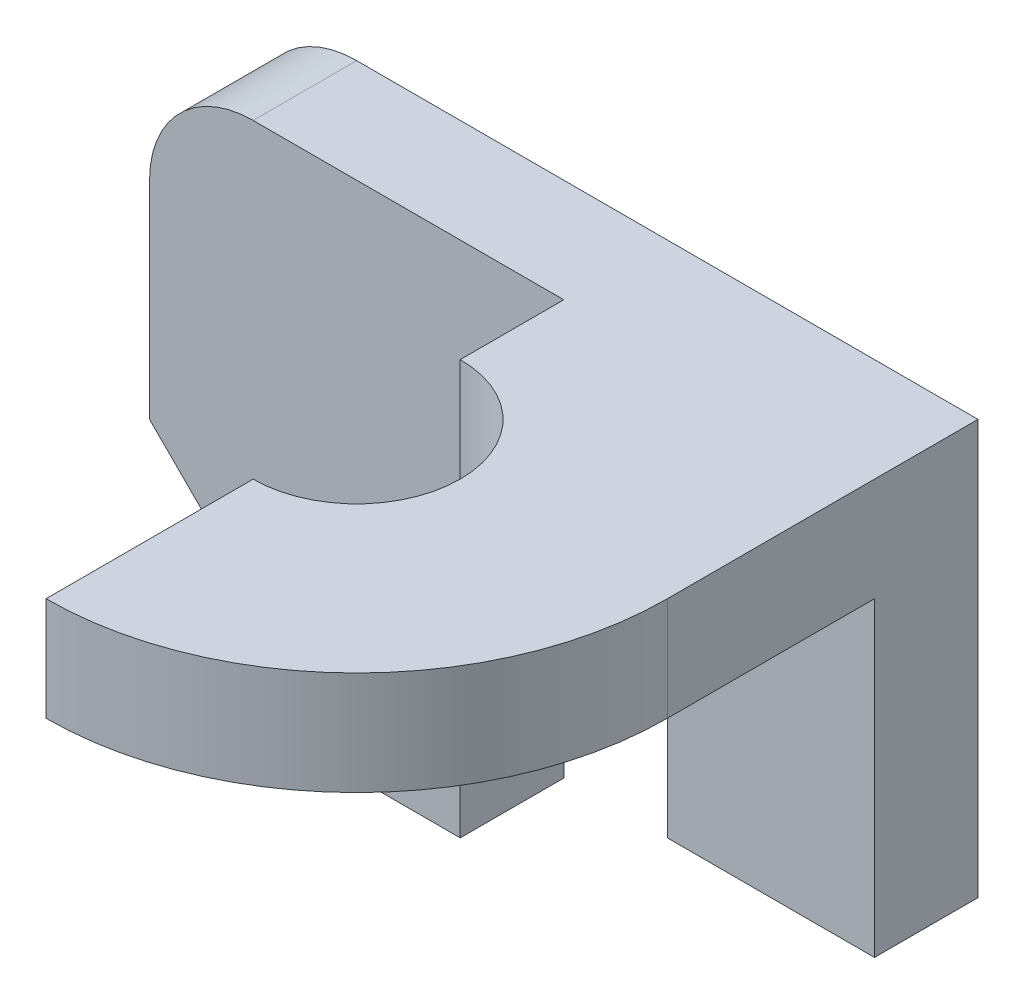
ISO-10303-21;
HEADER;
FILE_DESCRIPTION(('STEP AP214'),'2;1');
FILE_NAME('part.step','',(''),(''),'','','');
FILE_SCHEMA(('AUTOMOTIVE_DESIGN { 1 0 10303 214 1 1 1 1 }'));
ENDSEC;
DATA;
#1=APPLICATION_CONTEXT('core data for automotive mechanical design processes');
#2=APPLICATION_PROTOCOL_DEFINITION('international standard','automotive_design',2000,#1);
#3=PRODUCT_CONTEXT('',#1,'mechanical');
#4=PRODUCT('Part','Part','',(#3));
#5=PRODUCT_RELATED_PRODUCT_CATEGORY('part','',(#4));
#6=PRODUCT_DEFINITION_FORMATION('','',#4);
#7=PRODUCT_DEFINITION_CONTEXT('part definition',#1,'design');
#8=PRODUCT_DEFINITION('design','',#6,#7);
#9=PRODUCT_DEFINITION_SHAPE('','',#8);
#10=(LENGTH_UNIT() NAMED_UNIT(*) SI_UNIT(.MILLI.,.METRE.));
#11=(NAMED_UNIT(*) PLANE_ANGLE_UNIT() SI_UNIT($,.RADIAN.));
#12=(NAMED_UNIT(*) SI_UNIT($,.STERADIAN.) SOLID_ANGLE_UNIT());
#13=UNCERTAINTY_MEASURE_WITH_UNIT(LENGTH_MEASURE(1.E-05),#10,'distance_accuracy_value','');
#14=(GEOMETRIC_REPRESENTATION_CONTEXT(3) GLOBAL_UNCERTAINTY_ASSIGNED_CONTEXT((#13)) GLOBAL_UNIT_ASSIGNED_CONTEXT((#10,
#11,#12)) REPRESENTATION_CONTEXT('',''));
#15=CARTESIAN_POINT('',(0.,0.,0.));
#16=DIRECTION('',(0.,0.,1.));
#17=DIRECTION('',(1.,0.,0.));
#18=AXIS2_PLACEMENT_3D('',#15,#16,#17);
#19=CARTESIAN_POINT('',(0.,0.,1.));
#20=DIRECTION('',(1.,0.,0.));
#21=DIRECTION('',(0.,0.,-1.));
#22=AXIS2_PLACEMENT_3D('',#19,#20,#21);
#23=PLANE('',#22);
#24=DIRECTION('',(0.,-1.,0.));
#25=VECTOR('',#24,1.);
#26=CARTESIAN_POINT('',(0.,0.,0.));
#27=LINE('',#26,#25);
#28=CARTESIAN_POINT('',(0.,0.999999999999999,0.));
#29=VERTEX_POINT('',#28);
#30=CARTESIAN_POINT('',(0.,0.,0.));
#31=VERTEX_POINT('',#30);
#32=EDGE_CURVE('E154',#29,#31,#27,.T.);
#33=ORIENTED_EDGE('',*,*,#32,.T.);
#34=DIRECTION('',(0.,0.,-1.));
#35=VECTOR('',#34,1.);
#36=CARTESIAN_POINT('',(0.,0.,1.));
#37=LINE('',#36,#35);
#38=CARTESIAN_POINT('',(0.,0.,1.));
#39=VERTEX_POINT('',#38);
#40=EDGE_CURVE('E11',#39,#31,#37,.T.);
#41=ORIENTED_EDGE('',*,*,#40,.F.);
#42=DIRECTION('',(0.,-1.,0.));
#43=VECTOR('',#42,1.);
#44=CARTESIAN_POINT('',(0.,0.,1.));
#45=LINE('',#44,#43);
#46=CARTESIAN_POINT('',(0.,0.999999999999999,1.));
#47=VERTEX_POINT('',#46);
#48=EDGE_CURVE('E174',#47,#39,#45,.T.);
#49=ORIENTED_EDGE('',*,*,#48,.F.);
#50=DIRECTION('',(0.,0.,-1.));
#51=VECTOR('',#50,1.);
#52=CARTESIAN_POINT('',(0.,0.999999999999999,1.));
#53=LINE('',#52,#51);
#54=EDGE_CURVE('E150',#47,#29,#53,.T.);
#55=ORIENTED_EDGE('',*,*,#54,.T.);
#56=EDGE_LOOP('',(#33,#41,#49,#55));
#57=FACE_BOUND('',#56,.T.);
#58=ADVANCED_FACE('F34',(#57),#23,.F.);
#59=CARTESIAN_POINT('',(0.,0.,1.));
#60=DIRECTION('',(0.,1.,0.));
#61=DIRECTION('',(0.,0.,1.));
#62=AXIS2_PLACEMENT_3D('',#59,#60,#61);
#63=PLANE('',#62);
#64=DIRECTION('',(1.,0.,0.));
#65=VECTOR('',#64,1.);
#66=CARTESIAN_POINT('',(0.,0.,0.));
#67=LINE('',#66,#65);
#68=CARTESIAN_POINT('',(2.,0.,0.));
#69=VERTEX_POINT('',#68);
#70=EDGE_CURVE('E157',#31,#69,#67,.T.);
#71=ORIENTED_EDGE('',*,*,#70,.T.);
#72=DIRECTION('',(0.,0.,-1.));
#73=VECTOR('',#72,1.);
#74=CARTESIAN_POINT('',(2.,0.,1.));
#75=LINE('',#74,#73);
#76=CARTESIAN_POINT('',(2.,0.,1.));
#77=VERTEX_POINT('',#76);
#78=EDGE_CURVE('E42',#77,#69,#75,.T.);
#79=ORIENTED_EDGE('',*,*,#78,.F.);
#80=DIRECTION('',(1.,0.,0.));
#81=VECTOR('',#80,1.);
#82=CARTESIAN_POINT('',(0.,0.,1.));
#83=LINE('',#82,#81);
#84=EDGE_CURVE('E106',#39,#77,#83,.T.);
#85=ORIENTED_EDGE('',*,*,#84,.F.);
#86=ORIENTED_EDGE('',*,*,#40,.T.);
#87=EDGE_LOOP('',(#71,#79,#85,#86));
#88=FACE_BOUND('',#87,.T.);
#89=ADVANCED_FACE('F318',(#88),#63,.F.);
#90=CARTESIAN_POINT('',(2.,0.,1.));
#91=DIRECTION('',(-1.,0.,0.));
#92=DIRECTION('',(0.,0.,1.));
#93=AXIS2_PLACEMENT_3D('',#90,#91,#92);
#94=PLANE('',#93);
#95=DIRECTION('',(0.,1.,0.));
#96=VECTOR('',#95,1.);
#97=CARTESIAN_POINT('',(2.,0.,0.));
#98=LINE('',#97,#96);
#99=CARTESIAN_POINT('',(2.,4.,0.));
#100=VERTEX_POINT('',#99);
#101=EDGE_CURVE('E160',#69,#100,#98,.T.);
#102=ORIENTED_EDGE('',*,*,#101,.T.);
#103=DIRECTION('',(0.,0.,-1.));
#104=VECTOR('',#103,1.);
#105=CARTESIAN_POINT('',(2.,4.,1.));
#106=LINE('',#105,#104);
#107=CARTESIAN_POINT('',(2.,4.,3.));
#108=VERTEX_POINT('',#107);
#109=EDGE_CURVE('E187',#108,#100,#106,.T.);
#110=ORIENTED_EDGE('',*,*,#109,.F.);
#111=DIRECTION('',(0.,1.,0.));
#112=VECTOR('',#111,1.);
#113=CARTESIAN_POINT('',(2.,3.,3.));
#114=LINE('',#113,#112);
#115=CARTESIAN_POINT('',(2.,3.,3.));
#116=VERTEX_POINT('',#115);
#117=EDGE_CURVE('E233',#116,#108,#114,.T.);
#118=ORIENTED_EDGE('',*,*,#117,.F.);
#119=DIRECTION('',(0.,0.,-1.));
#120=VECTOR('',#119,1.);
#121=CARTESIAN_POINT('',(2.,3.,1.));
#122=LINE('',#121,#120);
#123=CARTESIAN_POINT('',(2.,3.,1.));
#124=VERTEX_POINT('',#123);
#125=EDGE_CURVE('E244',#116,#124,#122,.T.);
#126=ORIENTED_EDGE('',*,*,#125,.T.);
#127=DIRECTION('',(0.,1.,0.));
#128=VECTOR('',#127,1.);
#129=CARTESIAN_POINT('',(2.,0.,1.));
#130=LINE('',#129,#128);
#131=EDGE_CURVE('E192',#77,#124,#130,.T.);
#132=ORIENTED_EDGE('',*,*,#131,.F.);
#133=ORIENTED_EDGE('',*,*,#78,.T.);
#134=EDGE_LOOP('',(#102,#110,#118,#126,#132,#133));
#135=FACE_BOUND('',#134,.T.);
#136=ADVANCED_FACE('F317',(#135),#94,.F.);
#137=CARTESIAN_POINT('',(2.,4.,1.));
#138=DIRECTION('',(0.,-1.,0.));
#139=DIRECTION('',(1.,0.,0.));
#140=AXIS2_PLACEMENT_3D('',#137,#138,#139);
#141=PLANE('',#140);
#142=DIRECTION('',(-1.,0.,0.));
#143=VECTOR('',#142,1.);
#144=CARTESIAN_POINT('',(2.,4.,0.));
#145=LINE('',#144,#143);
#146=CARTESIAN_POINT('',(-4.,4.,0.));
#147=VERTEX_POINT('',#146);
#148=EDGE_CURVE('E162',#100,#147,#145,.T.);
#149=ORIENTED_EDGE('',*,*,#148,.T.);
#150=DIRECTION('',(0.,0.,-1.));
#151=VECTOR('',#150,1.);
#152=CARTESIAN_POINT('',(-4.,4.,1.));
#153=LINE('',#152,#151);
#154=CARTESIAN_POINT('',(-4.,4.,1.));
#155=VERTEX_POINT('',#154);
#156=EDGE_CURVE('E184',#155,#147,#153,.T.);
#157=ORIENTED_EDGE('',*,*,#156,.F.);
#158=DIRECTION('',(-1.,0.,0.));
#159=VECTOR('',#158,1.);
#160=CARTESIAN_POINT('',(2.,4.,1.));
#161=LINE('',#160,#159);
#162=CARTESIAN_POINT('',(-1.,4.,1.));
#163=VERTEX_POINT('',#162);
#164=EDGE_CURVE('E195',#163,#155,#161,.T.);
#165=ORIENTED_EDGE('',*,*,#164,.F.);
#166=DIRECTION('',(0.,0.,1.));
#167=VECTOR('',#166,1.);
#168=CARTESIAN_POINT('',(-1.,4.,1.));
#169=LINE('',#168,#167);
#170=CARTESIAN_POINT('',(-1.,4.,2.));
#171=VERTEX_POINT('',#170);
#172=EDGE_CURVE('E50',#163,#171,#169,.T.);
#173=ORIENTED_EDGE('',*,*,#172,.T.);
#174=CARTESIAN_POINT('',(-0.999999999999999,4.,3.));
#175=DIRECTION('',(0.,-1.,0.));
#176=DIRECTION('',(1.,0.,0.));
#177=AXIS2_PLACEMENT_3D('',#174,#175,#176);
#178=CIRCLE('',#177,1.);
#179=CARTESIAN_POINT('',(-1.,4.,4.));
#180=VERTEX_POINT('',#179);
#181=EDGE_CURVE('E304',#171,#180,#178,.T.);
#182=ORIENTED_EDGE('',*,*,#181,.T.);
#183=DIRECTION('',(0.,0.,1.));
#184=VECTOR('',#183,1.);
#185=CARTESIAN_POINT('',(-1.,4.,4.));
#186=LINE('',#185,#184);
#187=CARTESIAN_POINT('',(-1.,4.,6.));
#188=VERTEX_POINT('',#187);
#189=EDGE_CURVE('E306',#180,#188,#186,.T.);
#190=ORIENTED_EDGE('',*,*,#189,.T.);
#191=CARTESIAN_POINT('',(-0.999999999999999,4.,3.));
#192=DIRECTION('',(0.,1.,0.));
#193=DIRECTION('',(1.,0.,0.));
#194=AXIS2_PLACEMENT_3D('',#191,#192,#193);
#195=CIRCLE('',#194,3.);
#196=EDGE_CURVE('E238',#188,#108,#195,.T.);
#197=ORIENTED_EDGE('',*,*,#196,.T.);
#198=ORIENTED_EDGE('',*,*,#109,.T.);
#199=EDGE_LOOP('',(#149,#157,#165,#173,#182,#190,#197,#198));
#200=FACE_BOUND('',#199,.T.);
#201=ADVANCED_FACE('F310',(#200),#141,.F.);
#202=CARTESIAN_POINT('',(-4.,2.99999999999999,1.));
#203=DIRECTION('',(0.,0.,-1.));
#204=DIRECTION('',(-1.,0.,0.));
#205=AXIS2_PLACEMENT_3D('',#202,#203,#204);
#206=CYLINDRICAL_SURFACE('',#205,1.);
#207=CARTESIAN_POINT('',(-4.,2.99999999999999,0.));
#208=DIRECTION('',(0.,0.,1.));
#209=DIRECTION('',(1.,0.,0.));
#210=AXIS2_PLACEMENT_3D('',#207,#208,#209);
#211=CIRCLE('',#210,1.);
#212=CARTESIAN_POINT('',(-5.,3.,0.));
#213=VERTEX_POINT('',#212);
#214=EDGE_CURVE('E164',#147,#213,#211,.T.);
#215=ORIENTED_EDGE('',*,*,#214,.T.);
#216=DIRECTION('',(0.,0.,-1.));
#217=VECTOR('',#216,1.);
#218=CARTESIAN_POINT('',(-5.,3.,1.));
#219=LINE('',#218,#217);
#220=CARTESIAN_POINT('',(-5.,3.,1.));
#221=VERTEX_POINT('',#220);
#222=EDGE_CURVE('E181',#221,#213,#219,.T.);
#223=ORIENTED_EDGE('',*,*,#222,.F.);
#224=CARTESIAN_POINT('',(-4.,2.99999999999999,1.));
#225=DIRECTION('',(0.,0.,1.));
#226=DIRECTION('',(1.,0.,0.));
#227=AXIS2_PLACEMENT_3D('',#224,#225,#226);
#228=CIRCLE('',#227,1.);
#229=EDGE_CURVE('E203',#155,#221,#228,.T.);
#230=ORIENTED_EDGE('',*,*,#229,.F.);
#231=ORIENTED_EDGE('',*,*,#156,.T.);
#232=EDGE_LOOP('',(#215,#223,#230,#231));
#233=FACE_BOUND('',#232,.T.);
#234=ADVANCED_FACE('F315',(#233),#206,.T.);
#235=CARTESIAN_POINT('',(-5.,3.,1.));
#236=DIRECTION('',(1.,0.,0.));
#237=DIRECTION('',(0.,0.,-1.));
#238=AXIS2_PLACEMENT_3D('',#235,#236,#237);
#239=PLANE('',#238);
#240=DIRECTION('',(0.,-1.,0.));
#241=VECTOR('',#240,1.);
#242=CARTESIAN_POINT('',(-5.,3.,0.));
#243=LINE('',#242,#241);
#244=CARTESIAN_POINT('',(-5.,0.999999999999999,0.));
#245=VERTEX_POINT('',#244);
#246=EDGE_CURVE('E166',#213,#245,#243,.T.);
#247=ORIENTED_EDGE('',*,*,#246,.T.);
#248=DIRECTION('',(0.,0.,-1.));
#249=VECTOR('',#248,1.);
#250=CARTESIAN_POINT('',(-5.,0.999999999999999,1.));
#251=LINE('',#250,#249);
#252=CARTESIAN_POINT('',(-5.,0.999999999999999,1.));
#253=VERTEX_POINT('',#252);
#254=EDGE_CURVE('E178',#253,#245,#251,.T.);
#255=ORIENTED_EDGE('',*,*,#254,.F.);
#256=DIRECTION('',(0.,-1.,0.));
#257=VECTOR('',#256,1.);
#258=CARTESIAN_POINT('',(-5.,3.,1.));
#259=LINE('',#258,#257);
#260=EDGE_CURVE('E205',#221,#253,#259,.T.);
#261=ORIENTED_EDGE('',*,*,#260,.F.);
#262=ORIENTED_EDGE('',*,*,#222,.T.);
#263=EDGE_LOOP('',(#247,#255,#261,#262));
#264=FACE_BOUND('',#263,.T.);
#265=ADVANCED_FACE('F211',(#264),#239,.F.);
#266=CARTESIAN_POINT('',(-5.,0.999999999999999,1.));
#267=DIRECTION('',(0.707106781186547,0.707106781186547,0.));
#268=DIRECTION('',(-0.707106781186548,0.707106781186548,0.));
#269=AXIS2_PLACEMENT_3D('',#266,#267,#268);
#270=PLANE('',#269);
#271=DIRECTION('',(0.707106781186548,-0.707106781186548,0.));
#272=VECTOR('',#271,1.);
#273=CARTESIAN_POINT('',(-5.,0.999999999999999,0.));
#274=LINE('',#273,#272);
#275=CARTESIAN_POINT('',(-3.,-1.,0.));
#276=VERTEX_POINT('',#275);
#277=EDGE_CURVE('E168',#245,#276,#274,.T.);
#278=ORIENTED_EDGE('',*,*,#277,.T.);
#279=DIRECTION('',(0.,0.,-1.));
#280=VECTOR('',#279,1.);
#281=CARTESIAN_POINT('',(-3.,-1.,1.));
#282=LINE('',#281,#280);
#283=CARTESIAN_POINT('',(-3.,-1.,1.));
#284=VERTEX_POINT('',#283);
#285=EDGE_CURVE('E145',#284,#276,#282,.T.);
#286=ORIENTED_EDGE('',*,*,#285,.F.);
#287=DIRECTION('',(0.707106781186548,-0.707106781186548,0.));
#288=VECTOR('',#287,1.);
#289=CARTESIAN_POINT('',(-5.,0.999999999999999,1.));
#290=LINE('',#289,#288);
#291=EDGE_CURVE('E133',#253,#284,#290,.T.);
#292=ORIENTED_EDGE('',*,*,#291,.F.);
#293=ORIENTED_EDGE('',*,*,#254,.T.);
#294=EDGE_LOOP('',(#278,#286,#292,#293));
#295=FACE_BOUND('',#294,.T.);
#296=ADVANCED_FACE('F215',(#295),#270,.F.);
#297=CARTESIAN_POINT('',(-3.,-1.,1.));
#298=DIRECTION('',(0.,1.,0.));
#299=DIRECTION('',(0.,0.,1.));
#300=AXIS2_PLACEMENT_3D('',#297,#298,#299);
#301=PLANE('',#300);
#302=DIRECTION('',(1.,0.,0.));
#303=VECTOR('',#302,1.);
#304=CARTESIAN_POINT('',(-3.,-1.,0.));
#305=LINE('',#304,#303);
#306=CARTESIAN_POINT('',(-2.,-1.,0.));
#307=VERTEX_POINT('',#306);
#308=EDGE_CURVE('E142',#276,#307,#305,.T.);
#309=ORIENTED_EDGE('',*,*,#308,.T.);
#310=DIRECTION('',(0.,0.,-1.));
#311=VECTOR('',#310,1.);
#312=CARTESIAN_POINT('',(-2.,-1.,1.));
#313=LINE('',#312,#311);
#314=CARTESIAN_POINT('',(-2.,-1.,1.));
#315=VERTEX_POINT('',#314);
#316=EDGE_CURVE('E139',#315,#307,#313,.T.);
#317=ORIENTED_EDGE('',*,*,#316,.F.);
#318=DIRECTION('',(1.,0.,0.));
#319=VECTOR('',#318,1.);
#320=CARTESIAN_POINT('',(-3.,-1.,1.));
#321=LINE('',#320,#319);
#322=EDGE_CURVE('E125',#284,#315,#321,.T.);
#323=ORIENTED_EDGE('',*,*,#322,.F.);
#324=ORIENTED_EDGE('',*,*,#285,.T.);
#325=EDGE_LOOP('',(#309,#317,#323,#324));
#326=FACE_BOUND('',#325,.T.);
#327=ADVANCED_FACE('F140',(#326),#301,.F.);
#328=CARTESIAN_POINT('',(-2.,-1.,1.));
#329=DIRECTION('',(-1.,0.,0.));
#330=DIRECTION('',(0.,0.,1.));
#331=AXIS2_PLACEMENT_3D('',#328,#329,#330);
#332=PLANE('',#331);
#333=DIRECTION('',(0.,1.,0.));
#334=VECTOR('',#333,1.);
#335=CARTESIAN_POINT('',(-2.,-1.,0.));
#336=LINE('',#335,#334);
#337=CARTESIAN_POINT('',(-2.,0.999999999999999,0.));
#338=VERTEX_POINT('',#337);
#339=EDGE_CURVE('E171',#307,#338,#336,.T.);
#340=ORIENTED_EDGE('',*,*,#339,.T.);
#341=DIRECTION('',(0.,0.,-1.));
#342=VECTOR('',#341,1.);
#343=CARTESIAN_POINT('',(-2.,0.999999999999999,1.));
#344=LINE('',#343,#342);
#345=CARTESIAN_POINT('',(-2.,0.999999999999999,1.));
#346=VERTEX_POINT('',#345);
#347=EDGE_CURVE('E146',#346,#338,#344,.T.);
#348=ORIENTED_EDGE('',*,*,#347,.F.);
#349=DIRECTION('',(0.,1.,0.));
#350=VECTOR('',#349,1.);
#351=CARTESIAN_POINT('',(-2.,-1.,1.));
#352=LINE('',#351,#350);
#353=EDGE_CURVE('E130',#315,#346,#352,.T.);
#354=ORIENTED_EDGE('',*,*,#353,.F.);
#355=ORIENTED_EDGE('',*,*,#316,.T.);
#356=EDGE_LOOP('',(#340,#348,#354,#355));
#357=FACE_BOUND('',#356,.T.);
#358=ADVANCED_FACE('F148',(#357),#332,.F.);
#359=CARTESIAN_POINT('',(-1.,0.999999999999999,1.));
#360=DIRECTION('',(0.,0.,-1.));
#361=DIRECTION('',(-1.,0.,0.));
#362=AXIS2_PLACEMENT_3D('',#359,#360,#361);
#363=CYLINDRICAL_SURFACE('',#362,1.);
#364=CARTESIAN_POINT('',(-1.,0.999999999999999,0.));
#365=DIRECTION('',(0.,0.,-1.));
#366=DIRECTION('',(-1.,0.,0.));
#367=AXIS2_PLACEMENT_3D('',#364,#365,#366);
#368=CIRCLE('',#367,1.);
#369=EDGE_CURVE('E98',#338,#29,#368,.T.);
#370=ORIENTED_EDGE('',*,*,#369,.T.);
#371=ORIENTED_EDGE('',*,*,#54,.F.);
#372=CARTESIAN_POINT('',(-1.,0.999999999999999,1.));
#373=DIRECTION('',(0.,0.,-1.));
#374=DIRECTION('',(-1.,0.,0.));
#375=AXIS2_PLACEMENT_3D('',#372,#373,#374);
#376=CIRCLE('',#375,1.);
#377=EDGE_CURVE('E59',#346,#47,#376,.T.);
#378=ORIENTED_EDGE('',*,*,#377,.F.);
#379=ORIENTED_EDGE('',*,*,#347,.T.);
#380=EDGE_LOOP('',(#370,#371,#378,#379));
#381=FACE_BOUND('',#380,.T.);
#382=ADVANCED_FACE('F219',(#381),#363,.F.);
#383=CARTESIAN_POINT('',(-1.,0.999999999999999,1.));
#384=DIRECTION('',(0.,0.,-1.));
#385=DIRECTION('',(-1.,0.,0.));
#386=AXIS2_PLACEMENT_3D('',#383,#384,#385);
#387=PLANE('',#386);
#388=ORIENTED_EDGE('',*,*,#131,.T.);
#389=DIRECTION('',(-1.,0.,0.));
#390=VECTOR('',#389,1.);
#391=CARTESIAN_POINT('',(-1.,3.,1.));
#392=LINE('',#391,#390);
#393=CARTESIAN_POINT('',(-1.,3.,1.));
#394=VERTEX_POINT('',#393);
#395=EDGE_CURVE('E227',#124,#394,#392,.T.);
#396=ORIENTED_EDGE('',*,*,#395,.T.);
#397=DIRECTION('',(0.,1.,0.));
#398=VECTOR('',#397,1.);
#399=CARTESIAN_POINT('',(-1.,3.,1.));
#400=LINE('',#399,#398);
#401=EDGE_CURVE('E158',#394,#163,#400,.T.);
#402=ORIENTED_EDGE('',*,*,#401,.T.);
#403=ORIENTED_EDGE('',*,*,#164,.T.);
#404=ORIENTED_EDGE('',*,*,#229,.T.);
#405=ORIENTED_EDGE('',*,*,#260,.T.);
#406=ORIENTED_EDGE('',*,*,#291,.T.);
#407=ORIENTED_EDGE('',*,*,#322,.T.);
#408=ORIENTED_EDGE('',*,*,#353,.T.);
#409=ORIENTED_EDGE('',*,*,#377,.T.);
#410=ORIENTED_EDGE('',*,*,#48,.T.);
#411=ORIENTED_EDGE('',*,*,#84,.T.);
#412=EDGE_LOOP('',(#388,#396,#402,#403,#404,#405,#406,#407,#408,#409,#410,#411));
#413=FACE_BOUND('',#412,.T.);
#414=ADVANCED_FACE('F128',(#413),#387,.F.);
#415=CARTESIAN_POINT('',(-1.,0.999999999999999,0.));
#416=DIRECTION('',(0.,0.,-1.));
#417=DIRECTION('',(-1.,0.,0.));
#418=AXIS2_PLACEMENT_3D('',#415,#416,#417);
#419=PLANE('',#418);
#420=ORIENTED_EDGE('',*,*,#32,.F.);
#421=ORIENTED_EDGE('',*,*,#369,.F.);
#422=ORIENTED_EDGE('',*,*,#339,.F.);
#423=ORIENTED_EDGE('',*,*,#308,.F.);
#424=ORIENTED_EDGE('',*,*,#277,.F.);
#425=ORIENTED_EDGE('',*,*,#246,.F.);
#426=ORIENTED_EDGE('',*,*,#214,.F.);
#427=ORIENTED_EDGE('',*,*,#148,.F.);
#428=ORIENTED_EDGE('',*,*,#101,.F.);
#429=ORIENTED_EDGE('',*,*,#70,.F.);
#430=EDGE_LOOP('',(#420,#421,#422,#423,#424,#425,#426,#427,#428,#429));
#431=FACE_BOUND('',#430,.T.);
#432=ADVANCED_FACE('F218',(#431),#419,.T.);
#433=CARTESIAN_POINT('',(-1.,3.,1.));
#434=DIRECTION('',(-1.,0.,0.));
#435=DIRECTION('',(0.,0.,1.));
#436=AXIS2_PLACEMENT_3D('',#433,#434,#435);
#437=PLANE('',#436);
#438=ORIENTED_EDGE('',*,*,#172,.F.);
#439=ORIENTED_EDGE('',*,*,#401,.F.);
#440=DIRECTION('',(0.,0.,1.));
#441=VECTOR('',#440,1.);
#442=CARTESIAN_POINT('',(-1.,3.,1.));
#443=LINE('',#442,#441);
#444=CARTESIAN_POINT('',(-1.,3.,2.));
#445=VERTEX_POINT('',#444);
#446=EDGE_CURVE('E264',#394,#445,#443,.T.);
#447=ORIENTED_EDGE('',*,*,#446,.T.);
#448=DIRECTION('',(0.,1.,0.));
#449=VECTOR('',#448,1.);
#450=CARTESIAN_POINT('',(-1.,3.,2.));
#451=LINE('',#450,#449);
#452=EDGE_CURVE('E224',#445,#171,#451,.T.);
#453=ORIENTED_EDGE('',*,*,#452,.T.);
#454=EDGE_LOOP('',(#438,#439,#447,#453));
#455=FACE_BOUND('',#454,.T.);
#456=ADVANCED_FACE('F308',(#455),#437,.T.);
#457=CARTESIAN_POINT('',(-0.999999999999999,3.,3.));
#458=DIRECTION('',(0.,1.,0.));
#459=DIRECTION('',(-1.,0.,0.));
#460=AXIS2_PLACEMENT_3D('',#457,#458,#459);
#461=CYLINDRICAL_SURFACE('',#460,3.);
#462=ORIENTED_EDGE('',*,*,#196,.F.);
#463=DIRECTION('',(0.,1.,0.));
#464=VECTOR('',#463,1.);
#465=CARTESIAN_POINT('',(-0.999999999999999,3.,6.));
#466=LINE('',#465,#464);
#467=CARTESIAN_POINT('',(-0.999999999999999,3.,6.));
#468=VERTEX_POINT('',#467);
#469=EDGE_CURVE('E230',#468,#188,#466,.T.);
#470=ORIENTED_EDGE('',*,*,#469,.F.);
#471=CARTESIAN_POINT('',(-0.999999999999999,3.,3.));
#472=DIRECTION('',(0.,1.,0.));
#473=DIRECTION('',(1.,0.,0.));
#474=AXIS2_PLACEMENT_3D('',#471,#472,#473);
#475=CIRCLE('',#474,3.);
#476=EDGE_CURVE('E247',#468,#116,#475,.T.);
#477=ORIENTED_EDGE('',*,*,#476,.T.);
#478=ORIENTED_EDGE('',*,*,#117,.T.);
#479=EDGE_LOOP('',(#462,#470,#477,#478));
#480=FACE_BOUND('',#479,.T.);
#481=ADVANCED_FACE('F292',(#480),#461,.T.);
#482=CARTESIAN_POINT('',(-1.,3.,4.));
#483=DIRECTION('',(-1.,0.,0.));
#484=DIRECTION('',(0.,0.,1.));
#485=AXIS2_PLACEMENT_3D('',#482,#483,#484);
#486=PLANE('',#485);
#487=ORIENTED_EDGE('',*,*,#189,.F.);
#488=DIRECTION('',(0.,1.,0.));
#489=VECTOR('',#488,1.);
#490=CARTESIAN_POINT('',(-1.,3.,4.));
#491=LINE('',#490,#489);
#492=CARTESIAN_POINT('',(-1.,3.,4.));
#493=VERTEX_POINT('',#492);
#494=EDGE_CURVE('E226',#493,#180,#491,.T.);
#495=ORIENTED_EDGE('',*,*,#494,.F.);
#496=DIRECTION('',(0.,0.,1.));
#497=VECTOR('',#496,1.);
#498=CARTESIAN_POINT('',(-1.,3.,4.));
#499=LINE('',#498,#497);
#500=EDGE_CURVE('E296',#493,#468,#499,.T.);
#501=ORIENTED_EDGE('',*,*,#500,.T.);
#502=ORIENTED_EDGE('',*,*,#469,.T.);
#503=EDGE_LOOP('',(#487,#495,#501,#502));
#504=FACE_BOUND('',#503,.T.);
#505=ADVANCED_FACE('F298',(#504),#486,.T.);
#506=CARTESIAN_POINT('',(-0.999999999999999,3.,3.));
#507=DIRECTION('',(0.,1.,0.));
#508=DIRECTION('',(-1.,0.,0.));
#509=AXIS2_PLACEMENT_3D('',#506,#507,#508);
#510=CYLINDRICAL_SURFACE('',#509,1.);
#511=ORIENTED_EDGE('',*,*,#181,.F.);
#512=ORIENTED_EDGE('',*,*,#452,.F.);
#513=CARTESIAN_POINT('',(-0.999999999999999,3.,3.));
#514=DIRECTION('',(0.,-1.,0.));
#515=DIRECTION('',(1.,0.,0.));
#516=AXIS2_PLACEMENT_3D('',#513,#514,#515);
#517=CIRCLE('',#516,1.);
#518=EDGE_CURVE('E299',#445,#493,#517,.T.);
#519=ORIENTED_EDGE('',*,*,#518,.T.);
#520=ORIENTED_EDGE('',*,*,#494,.T.);
#521=EDGE_LOOP('',(#511,#512,#519,#520));
#522=FACE_BOUND('',#521,.T.);
#523=ADVANCED_FACE('F309',(#522),#510,.F.);
#524=CARTESIAN_POINT('',(-0.999999999999999,3.,3.));
#525=DIRECTION('',(0.,-1.,0.));
#526=DIRECTION('',(1.,0.,0.));
#527=AXIS2_PLACEMENT_3D('',#524,#525,#526);
#528=PLANE('',#527);
#529=ORIENTED_EDGE('',*,*,#446,.F.);
#530=ORIENTED_EDGE('',*,*,#395,.F.);
#531=ORIENTED_EDGE('',*,*,#125,.F.);
#532=ORIENTED_EDGE('',*,*,#476,.F.);
#533=ORIENTED_EDGE('',*,*,#500,.F.);
#534=ORIENTED_EDGE('',*,*,#518,.F.);
#535=EDGE_LOOP('',(#529,#530,#531,#532,#533,#534));
#536=FACE_BOUND('',#535,.T.);
#537=ADVANCED_FACE('F258',(#536),#528,.T.);
#538=CLOSED_SHELL('',(#58,#89,#136,#201,#234,#265,#296,#327,#358,#382,#414,#432,#456,#481,#505,
#523,#537));
#539=MANIFOLD_SOLID_BREP('B2',#538);
#540=ADVANCED_BREP_SHAPE_REPRESENTATION('',(#18,#539),#14);
#541=SHAPE_DEFINITION_REPRESENTATION(#9,#540);
ENDSEC;
END-ISO-10303-21;
